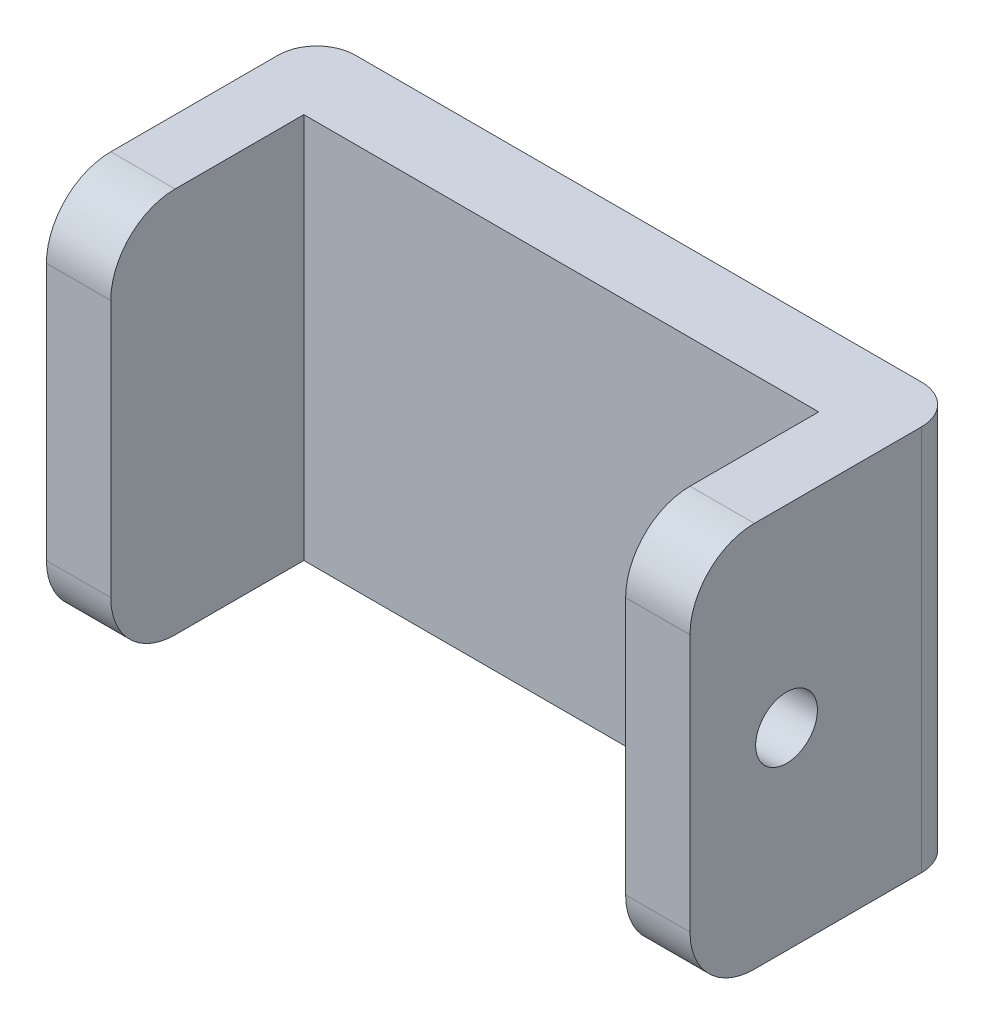
ISO-10303-21;
HEADER;
FILE_DESCRIPTION(('STEP AP214'),'2;1');
FILE_NAME('part.step','',(''),(''),'','','');
FILE_SCHEMA(('AUTOMOTIVE_DESIGN { 1 0 10303 214 1 1 1 1 }'));
ENDSEC;
DATA;
#1=APPLICATION_CONTEXT('core data for automotive mechanical design processes');
#2=APPLICATION_PROTOCOL_DEFINITION('international standard','automotive_design',2000,#1);
#3=PRODUCT_CONTEXT('',#1,'mechanical');
#4=PRODUCT('Part','Part','',(#3));
#5=PRODUCT_RELATED_PRODUCT_CATEGORY('part','',(#4));
#6=PRODUCT_DEFINITION_FORMATION('','',#4);
#7=PRODUCT_DEFINITION_CONTEXT('part definition',#1,'design');
#8=PRODUCT_DEFINITION('design','',#6,#7);
#9=PRODUCT_DEFINITION_SHAPE('','',#8);
#10=(LENGTH_UNIT() NAMED_UNIT(*) SI_UNIT(.MILLI.,.METRE.));
#11=(NAMED_UNIT(*) PLANE_ANGLE_UNIT() SI_UNIT($,.RADIAN.));
#12=(NAMED_UNIT(*) SI_UNIT($,.STERADIAN.) SOLID_ANGLE_UNIT());
#13=UNCERTAINTY_MEASURE_WITH_UNIT(LENGTH_MEASURE(1.E-05),#10,'distance_accuracy_value','');
#14=(GEOMETRIC_REPRESENTATION_CONTEXT(3) GLOBAL_UNCERTAINTY_ASSIGNED_CONTEXT((#13)) GLOBAL_UNIT_ASSIGNED_CONTEXT((#10,
#11,#12)) REPRESENTATION_CONTEXT('',''));
#15=CARTESIAN_POINT('',(0.,0.,0.));
#16=DIRECTION('',(0.,0.,1.));
#17=DIRECTION('',(1.,0.,0.));
#18=AXIS2_PLACEMENT_3D('',#15,#16,#17);
#19=CARTESIAN_POINT('',(0.,0.,6.));
#20=DIRECTION('',(0.,0.,1.));
#21=DIRECTION('',(1.,0.,0.));
#22=AXIS2_PLACEMENT_3D('',#19,#20,#21);
#23=PLANE('',#22);
#24=DIRECTION('',(-1.,0.,0.));
#25=VECTOR('',#24,1.);
#26=CARTESIAN_POINT('',(-286.5,-33.0000000000001,6.));
#27=LINE('',#26,#25);
#28=CARTESIAN_POINT('',(-241.5,-33.0000000000001,6.));
#29=VERTEX_POINT('',#28);
#30=CARTESIAN_POINT('',(-281.5,-33.0000000000001,6.));
#31=VERTEX_POINT('',#30);
#32=EDGE_CURVE('E155',#29,#31,#27,.T.);
#33=ORIENTED_EDGE('',*,*,#32,.T.);
#34=DIRECTION('',(0.,1.,0.));
#35=VECTOR('',#34,1.);
#36=CARTESIAN_POINT('',(-281.5,-63.0000000000001,6.));
#37=LINE('',#36,#35);
#38=CARTESIAN_POINT('',(-281.5,-63.0000000000001,6.));
#39=VERTEX_POINT('',#38);
#40=EDGE_CURVE('E154',#39,#31,#37,.T.);
#41=ORIENTED_EDGE('',*,*,#40,.F.);
#42=DIRECTION('',(1.,0.,0.));
#43=VECTOR('',#42,1.);
#44=CARTESIAN_POINT('',(-286.5,-63.0000000000001,6.));
#45=LINE('',#44,#43);
#46=CARTESIAN_POINT('',(-241.5,-63.0000000000001,6.));
#47=VERTEX_POINT('',#46);
#48=EDGE_CURVE('E138',#39,#47,#45,.T.);
#49=ORIENTED_EDGE('',*,*,#48,.T.);
#50=DIRECTION('',(0.,-1.,0.));
#51=VECTOR('',#50,1.);
#52=CARTESIAN_POINT('',(-241.5,-63.0000000000001,6.));
#53=LINE('',#52,#51);
#54=EDGE_CURVE('E151',#29,#47,#53,.T.);
#55=ORIENTED_EDGE('',*,*,#54,.F.);
#56=EDGE_LOOP('',(#33,#41,#49,#55));
#57=FACE_BOUND('',#56,.T.);
#58=ADVANCED_FACE('F32',(#57),#23,.T.);
#59=CARTESIAN_POINT('',(-286.5,-33.0000000000001,6.));
#60=DIRECTION('',(1.,0.,0.));
#61=DIRECTION('',(0.,0.,-1.));
#62=AXIS2_PLACEMENT_3D('',#59,#60,#61);
#63=PLANE('',#62);
#64=DIRECTION('',(0.,0.,-1.));
#65=VECTOR('',#64,1.);
#66=CARTESIAN_POINT('',(-286.5,-63.0000000000001,6.));
#67=LINE('',#66,#65);
#68=CARTESIAN_POINT('',(-286.5,-63.0000000000001,16.));
#69=VERTEX_POINT('',#68);
#70=CARTESIAN_POINT('',(-286.5,-63.0000000000001,3.));
#71=VERTEX_POINT('',#70);
#72=EDGE_CURVE('E182',#69,#71,#67,.T.);
#73=ORIENTED_EDGE('',*,*,#72,.F.);
#74=CARTESIAN_POINT('',(-286.5,-58.0000000000001,16.));
#75=DIRECTION('',(1.,0.,0.));
#76=DIRECTION('',(0.,0.,-1.));
#77=AXIS2_PLACEMENT_3D('',#74,#75,#76);
#78=CIRCLE('',#77,5.);
#79=CARTESIAN_POINT('',(-286.5,-58.0000000000001,21.));
#80=VERTEX_POINT('',#79);
#81=EDGE_CURVE('E11',#69,#80,#78,.F.);
#82=ORIENTED_EDGE('',*,*,#81,.T.);
#83=DIRECTION('',(0.,-1.,0.));
#84=VECTOR('',#83,1.);
#85=CARTESIAN_POINT('',(-286.5,-63.0000000000001,21.));
#86=LINE('',#85,#84);
#87=CARTESIAN_POINT('',(-286.5,-38.0000000000001,21.));
#88=VERTEX_POINT('',#87);
#89=EDGE_CURVE('E235',#88,#80,#86,.T.);
#90=ORIENTED_EDGE('',*,*,#89,.F.);
#91=CARTESIAN_POINT('',(-286.5,-38.0000000000001,16.));
#92=DIRECTION('',(1.,0.,0.));
#93=DIRECTION('',(0.,0.,-1.));
#94=AXIS2_PLACEMENT_3D('',#91,#92,#93);
#95=CIRCLE('',#94,5.);
#96=CARTESIAN_POINT('',(-286.5,-33.0000000000001,16.));
#97=VERTEX_POINT('',#96);
#98=EDGE_CURVE('E40',#88,#97,#95,.F.);
#99=ORIENTED_EDGE('',*,*,#98,.T.);
#100=DIRECTION('',(0.,0.,-1.));
#101=VECTOR('',#100,1.);
#102=CARTESIAN_POINT('',(-286.5,-33.0000000000001,6.));
#103=LINE('',#102,#101);
#104=CARTESIAN_POINT('',(-286.5,-33.0000000000001,3.));
#105=VERTEX_POINT('',#104);
#106=EDGE_CURVE('E172',#97,#105,#103,.T.);
#107=ORIENTED_EDGE('',*,*,#106,.T.);
#108=DIRECTION('',(0.,-1.,0.));
#109=VECTOR('',#108,1.);
#110=CARTESIAN_POINT('',(-286.5,-33.0000000000001,3.));
#111=LINE('',#110,#109);
#112=EDGE_CURVE('E184',#105,#71,#111,.T.);
#113=ORIENTED_EDGE('',*,*,#112,.T.);
#114=EDGE_LOOP('',(#73,#82,#90,#99,#107,#113));
#115=FACE_BOUND('',#114,.T.);
#116=ADVANCED_FACE('F234',(#115),#63,.F.);
#117=CARTESIAN_POINT('',(-286.5,-63.0000000000001,6.));
#118=DIRECTION('',(0.,1.,0.));
#119=DIRECTION('',(0.,0.,1.));
#120=AXIS2_PLACEMENT_3D('',#117,#118,#119);
#121=PLANE('',#120);
#122=DIRECTION('',(0.,0.,-1.));
#123=VECTOR('',#122,1.);
#124=CARTESIAN_POINT('',(-236.5,-63.0000000000001,6.));
#125=LINE('',#124,#123);
#126=CARTESIAN_POINT('',(-236.5,-63.0000000000001,16.));
#127=VERTEX_POINT('',#126);
#128=CARTESIAN_POINT('',(-236.5,-63.0000000000001,3.));
#129=VERTEX_POINT('',#128);
#130=EDGE_CURVE('E180',#127,#129,#125,.T.);
#131=ORIENTED_EDGE('',*,*,#130,.F.);
#132=DIRECTION('',(1.,0.,0.));
#133=VECTOR('',#132,1.);
#134=CARTESIAN_POINT('',(-241.5,-63.0000000000001,16.));
#135=LINE('',#134,#133);
#136=CARTESIAN_POINT('',(-241.5,-63.0000000000001,16.));
#137=VERTEX_POINT('',#136);
#138=EDGE_CURVE('E140',#127,#137,#135,.F.);
#139=ORIENTED_EDGE('',*,*,#138,.T.);
#140=DIRECTION('',(0.,0.,-1.));
#141=VECTOR('',#140,1.);
#142=CARTESIAN_POINT('',(-241.5,-63.0000000000001,21.));
#143=LINE('',#142,#141);
#144=EDGE_CURVE('E133',#137,#47,#143,.T.);
#145=ORIENTED_EDGE('',*,*,#144,.T.);
#146=ORIENTED_EDGE('',*,*,#48,.F.);
#147=DIRECTION('',(0.,0.,-1.));
#148=VECTOR('',#147,1.);
#149=CARTESIAN_POINT('',(-281.5,-63.0000000000001,21.));
#150=LINE('',#149,#148);
#151=CARTESIAN_POINT('',(-281.5,-63.0000000000001,16.));
#152=VERTEX_POINT('',#151);
#153=EDGE_CURVE('E161',#152,#39,#150,.T.);
#154=ORIENTED_EDGE('',*,*,#153,.F.);
#155=DIRECTION('',(1.,0.,0.));
#156=VECTOR('',#155,1.);
#157=CARTESIAN_POINT('',(-286.5,-63.0000000000001,16.));
#158=LINE('',#157,#156);
#159=EDGE_CURVE('E214',#152,#69,#158,.F.);
#160=ORIENTED_EDGE('',*,*,#159,.T.);
#161=ORIENTED_EDGE('',*,*,#72,.T.);
#162=CARTESIAN_POINT('',(-283.5,-63.0000000000001,3.));
#163=DIRECTION('',(0.,1.,0.));
#164=DIRECTION('',(0.,0.,1.));
#165=AXIS2_PLACEMENT_3D('',#162,#163,#164);
#166=CIRCLE('',#165,3.);
#167=CARTESIAN_POINT('',(-283.5,-63.0000000000001,0.));
#168=VERTEX_POINT('',#167);
#169=EDGE_CURVE('E190',#71,#168,#166,.F.);
#170=ORIENTED_EDGE('',*,*,#169,.T.);
#171=DIRECTION('',(1.,0.,0.));
#172=VECTOR('',#171,1.);
#173=CARTESIAN_POINT('',(-286.5,-63.0000000000001,0.));
#174=LINE('',#173,#172);
#175=CARTESIAN_POINT('',(-239.5,-63.0000000000001,0.));
#176=VERTEX_POINT('',#175);
#177=EDGE_CURVE('E169',#168,#176,#174,.T.);
#178=ORIENTED_EDGE('',*,*,#177,.T.);
#179=CARTESIAN_POINT('',(-239.5,-63.0000000000001,3.));
#180=DIRECTION('',(0.,1.,0.));
#181=DIRECTION('',(0.,0.,1.));
#182=AXIS2_PLACEMENT_3D('',#179,#180,#181);
#183=CIRCLE('',#182,3.);
#184=EDGE_CURVE('E187',#176,#129,#183,.F.);
#185=ORIENTED_EDGE('',*,*,#184,.T.);
#186=EDGE_LOOP('',(#131,#139,#145,#146,#154,#160,#161,#170,#178,#185));
#187=FACE_BOUND('',#186,.T.);
#188=ADVANCED_FACE('F136',(#187),#121,.F.);
#189=CARTESIAN_POINT('',(-236.5,-33.0000000000001,6.));
#190=DIRECTION('',(-1.,0.,0.));
#191=DIRECTION('',(0.,-1.,0.));
#192=AXIS2_PLACEMENT_3D('',#189,#190,#191);
#193=PLANE('',#192);
#194=CARTESIAN_POINT('',(-236.5,-48.0000000000001,13.5));
#195=DIRECTION('',(1.,0.,0.));
#196=DIRECTION('',(0.,1.,0.));
#197=AXIS2_PLACEMENT_3D('',#194,#195,#196);
#198=CIRCLE('',#197,2.4);
#199=CARTESIAN_POINT('',(-236.5,-45.6000000000001,13.5));
#200=VERTEX_POINT('',#199);
#201=EDGE_CURVE('E341',#200,#200,#198,.T.);
#202=ORIENTED_EDGE('',*,*,#201,.F.);
#203=EDGE_LOOP('',(#202));
#204=FACE_BOUND('',#203,.T.);
#205=DIRECTION('',(0.,1.,0.));
#206=VECTOR('',#205,1.);
#207=CARTESIAN_POINT('',(-236.5,-63.0000000000001,21.));
#208=LINE('',#207,#206);
#209=CARTESIAN_POINT('',(-236.5,-58.0000000000001,21.));
#210=VERTEX_POINT('',#209);
#211=CARTESIAN_POINT('',(-236.5,-38.0000000000001,21.));
#212=VERTEX_POINT('',#211);
#213=EDGE_CURVE('E160',#210,#212,#208,.T.);
#214=ORIENTED_EDGE('',*,*,#213,.F.);
#215=CARTESIAN_POINT('',(-236.5,-58.0000000000001,16.));
#216=DIRECTION('',(-1.,0.,0.));
#217=DIRECTION('',(0.,-1.,0.));
#218=AXIS2_PLACEMENT_3D('',#215,#216,#217);
#219=CIRCLE('',#218,5.);
#220=EDGE_CURVE('E212',#210,#127,#219,.F.);
#221=ORIENTED_EDGE('',*,*,#220,.T.);
#222=ORIENTED_EDGE('',*,*,#130,.T.);
#223=DIRECTION('',(0.,1.,0.));
#224=VECTOR('',#223,1.);
#225=CARTESIAN_POINT('',(-236.5,-33.0000000000001,3.));
#226=LINE('',#225,#224);
#227=CARTESIAN_POINT('',(-236.5,-33.0000000000001,3.));
#228=VERTEX_POINT('',#227);
#229=EDGE_CURVE('E201',#129,#228,#226,.T.);
#230=ORIENTED_EDGE('',*,*,#229,.T.);
#231=DIRECTION('',(0.,0.,-1.));
#232=VECTOR('',#231,1.);
#233=CARTESIAN_POINT('',(-236.5,-33.0000000000001,6.));
#234=LINE('',#233,#232);
#235=CARTESIAN_POINT('',(-236.5,-33.0000000000001,16.));
#236=VERTEX_POINT('',#235);
#237=EDGE_CURVE('E178',#236,#228,#234,.T.);
#238=ORIENTED_EDGE('',*,*,#237,.F.);
#239=CARTESIAN_POINT('',(-236.5,-38.0000000000001,16.));
#240=DIRECTION('',(-1.,0.,0.));
#241=DIRECTION('',(0.,-1.,0.));
#242=AXIS2_PLACEMENT_3D('',#239,#240,#241);
#243=CIRCLE('',#242,5.);
#244=EDGE_CURVE('E210',#236,#212,#243,.F.);
#245=ORIENTED_EDGE('',*,*,#244,.T.);
#246=EDGE_LOOP('',(#214,#221,#222,#230,#238,#245));
#247=FACE_BOUND('',#246,.T.);
#248=ADVANCED_FACE('F284',(#204,#247),#193,.F.);
#249=CARTESIAN_POINT('',(-286.5,-33.0000000000001,6.));
#250=DIRECTION('',(0.,-1.,0.));
#251=DIRECTION('',(0.,0.,-1.));
#252=AXIS2_PLACEMENT_3D('',#249,#250,#251);
#253=PLANE('',#252);
#254=DIRECTION('',(0.,0.,-1.));
#255=VECTOR('',#254,1.);
#256=CARTESIAN_POINT('',(-241.5,-33.0000000000001,21.));
#257=LINE('',#256,#255);
#258=CARTESIAN_POINT('',(-241.5,-33.0000000000001,16.));
#259=VERTEX_POINT('',#258);
#260=EDGE_CURVE('E144',#259,#29,#257,.T.);
#261=ORIENTED_EDGE('',*,*,#260,.F.);
#262=DIRECTION('',(-1.,0.,0.));
#263=VECTOR('',#262,1.);
#264=CARTESIAN_POINT('',(-236.5,-33.0000000000001,16.));
#265=LINE('',#264,#263);
#266=EDGE_CURVE('E223',#259,#236,#265,.F.);
#267=ORIENTED_EDGE('',*,*,#266,.T.);
#268=ORIENTED_EDGE('',*,*,#237,.T.);
#269=CARTESIAN_POINT('',(-239.5,-33.0000000000001,3.));
#270=DIRECTION('',(0.,-1.,0.));
#271=DIRECTION('',(0.,0.,-1.));
#272=AXIS2_PLACEMENT_3D('',#269,#270,#271);
#273=CIRCLE('',#272,3.);
#274=CARTESIAN_POINT('',(-239.5,-33.0000000000001,0.));
#275=VERTEX_POINT('',#274);
#276=EDGE_CURVE('E196',#228,#275,#273,.F.);
#277=ORIENTED_EDGE('',*,*,#276,.T.);
#278=DIRECTION('',(-1.,0.,0.));
#279=VECTOR('',#278,1.);
#280=CARTESIAN_POINT('',(-286.5,-33.0000000000001,0.));
#281=LINE('',#280,#279);
#282=CARTESIAN_POINT('',(-283.5,-33.0000000000001,0.));
#283=VERTEX_POINT('',#282);
#284=EDGE_CURVE('E156',#275,#283,#281,.T.);
#285=ORIENTED_EDGE('',*,*,#284,.T.);
#286=CARTESIAN_POINT('',(-283.5,-33.0000000000001,3.));
#287=DIRECTION('',(0.,-1.,0.));
#288=DIRECTION('',(0.,0.,-1.));
#289=AXIS2_PLACEMENT_3D('',#286,#287,#288);
#290=CIRCLE('',#289,3.);
#291=EDGE_CURVE('E198',#283,#105,#290,.F.);
#292=ORIENTED_EDGE('',*,*,#291,.T.);
#293=ORIENTED_EDGE('',*,*,#106,.F.);
#294=DIRECTION('',(-1.,0.,0.));
#295=VECTOR('',#294,1.);
#296=CARTESIAN_POINT('',(-281.5,-33.0000000000001,16.));
#297=LINE('',#296,#295);
#298=CARTESIAN_POINT('',(-281.5,-33.0000000000001,16.));
#299=VERTEX_POINT('',#298);
#300=EDGE_CURVE('E221',#97,#299,#297,.F.);
#301=ORIENTED_EDGE('',*,*,#300,.T.);
#302=DIRECTION('',(0.,0.,-1.));
#303=VECTOR('',#302,1.);
#304=CARTESIAN_POINT('',(-281.5,-33.0000000000001,21.));
#305=LINE('',#304,#303);
#306=EDGE_CURVE('E165',#299,#31,#305,.T.);
#307=ORIENTED_EDGE('',*,*,#306,.T.);
#308=ORIENTED_EDGE('',*,*,#32,.F.);
#309=EDGE_LOOP('',(#261,#267,#268,#277,#285,#292,#293,#301,#307,#308));
#310=FACE_BOUND('',#309,.T.);
#311=ADVANCED_FACE('F237',(#310),#253,.F.);
#312=CARTESIAN_POINT('',(0.,0.,0.));
#313=DIRECTION('',(0.,0.,1.));
#314=DIRECTION('',(1.,0.,0.));
#315=AXIS2_PLACEMENT_3D('',#312,#313,#314);
#316=PLANE('',#315);
#317=ORIENTED_EDGE('',*,*,#177,.F.);
#318=DIRECTION('',(0.,-1.,0.));
#319=VECTOR('',#318,1.);
#320=CARTESIAN_POINT('',(-283.5,0.,0.));
#321=LINE('',#320,#319);
#322=EDGE_CURVE('E194',#168,#283,#321,.F.);
#323=ORIENTED_EDGE('',*,*,#322,.T.);
#324=ORIENTED_EDGE('',*,*,#284,.F.);
#325=DIRECTION('',(0.,1.,0.));
#326=VECTOR('',#325,1.);
#327=CARTESIAN_POINT('',(-239.5,2.21582011998104E-13,0.));
#328=LINE('',#327,#326);
#329=EDGE_CURVE('E192',#275,#176,#328,.F.);
#330=ORIENTED_EDGE('',*,*,#329,.T.);
#331=EDGE_LOOP('',(#317,#323,#324,#330));
#332=FACE_BOUND('',#331,.T.);
#333=ADVANCED_FACE('F278',(#332),#316,.F.);
#334=CARTESIAN_POINT('',(-241.5,-63.0000000000001,21.));
#335=DIRECTION('',(1.,0.,0.));
#336=DIRECTION('',(0.,0.,-1.));
#337=AXIS2_PLACEMENT_3D('',#334,#335,#336);
#338=PLANE('',#337);
#339=CARTESIAN_POINT('',(-241.5,-48.0000000000001,13.5));
#340=DIRECTION('',(1.,0.,0.));
#341=DIRECTION('',(0.,0.,-1.));
#342=AXIS2_PLACEMENT_3D('',#339,#340,#341);
#343=CIRCLE('',#342,2.4);
#344=CARTESIAN_POINT('',(-241.5,-48.0000000000001,11.1));
#345=VERTEX_POINT('',#344);
#346=EDGE_CURVE('E252',#345,#345,#343,.F.);
#347=ORIENTED_EDGE('',*,*,#346,.F.);
#348=EDGE_LOOP('',(#347));
#349=FACE_BOUND('',#348,.T.);
#350=ORIENTED_EDGE('',*,*,#144,.F.);
#351=CARTESIAN_POINT('',(-241.5,-58.0000000000001,16.));
#352=DIRECTION('',(1.,0.,0.));
#353=DIRECTION('',(0.,0.,-1.));
#354=AXIS2_PLACEMENT_3D('',#351,#352,#353);
#355=CIRCLE('',#354,5.);
#356=CARTESIAN_POINT('',(-241.5,-58.0000000000001,21.));
#357=VERTEX_POINT('',#356);
#358=EDGE_CURVE('E219',#137,#357,#355,.F.);
#359=ORIENTED_EDGE('',*,*,#358,.T.);
#360=DIRECTION('',(0.,-1.,0.));
#361=VECTOR('',#360,1.);
#362=CARTESIAN_POINT('',(-241.5,-63.0000000000001,21.));
#363=LINE('',#362,#361);
#364=CARTESIAN_POINT('',(-241.5,-38.0000000000001,21.));
#365=VERTEX_POINT('',#364);
#366=EDGE_CURVE('E145',#365,#357,#363,.T.);
#367=ORIENTED_EDGE('',*,*,#366,.F.);
#368=CARTESIAN_POINT('',(-241.5,-38.0000000000001,16.));
#369=DIRECTION('',(1.,0.,0.));
#370=DIRECTION('',(0.,0.,-1.));
#371=AXIS2_PLACEMENT_3D('',#368,#369,#370);
#372=CIRCLE('',#371,5.);
#373=EDGE_CURVE('E217',#365,#259,#372,.F.);
#374=ORIENTED_EDGE('',*,*,#373,.T.);
#375=ORIENTED_EDGE('',*,*,#260,.T.);
#376=ORIENTED_EDGE('',*,*,#54,.T.);
#377=EDGE_LOOP('',(#350,#359,#367,#374,#375,#376));
#378=FACE_BOUND('',#377,.T.);
#379=ADVANCED_FACE('F158',(#349,#378),#338,.F.);
#380=CARTESIAN_POINT('',(0.,0.,21.));
#381=DIRECTION('',(0.,0.,1.));
#382=DIRECTION('',(1.,0.,0.));
#383=AXIS2_PLACEMENT_3D('',#380,#381,#382);
#384=PLANE('',#383);
#385=ORIENTED_EDGE('',*,*,#366,.T.);
#386=DIRECTION('',(1.,0.,0.));
#387=VECTOR('',#386,1.);
#388=CARTESIAN_POINT('',(-236.5,-58.0000000000001,21.));
#389=LINE('',#388,#387);
#390=EDGE_CURVE('E207',#357,#210,#389,.T.);
#391=ORIENTED_EDGE('',*,*,#390,.T.);
#392=ORIENTED_EDGE('',*,*,#213,.T.);
#393=DIRECTION('',(-1.,0.,0.));
#394=VECTOR('',#393,1.);
#395=CARTESIAN_POINT('',(-241.5,-38.0000000000001,21.));
#396=LINE('',#395,#394);
#397=EDGE_CURVE('E204',#212,#365,#396,.T.);
#398=ORIENTED_EDGE('',*,*,#397,.T.);
#399=EDGE_LOOP('',(#385,#391,#392,#398));
#400=FACE_BOUND('',#399,.T.);
#401=ADVANCED_FACE('F307',(#400),#384,.T.);
#402=CARTESIAN_POINT('',(-281.5,-63.0000000000001,21.));
#403=DIRECTION('',(-1.,0.,0.));
#404=DIRECTION('',(0.,-1.,0.));
#405=AXIS2_PLACEMENT_3D('',#402,#403,#404);
#406=PLANE('',#405);
#407=DIRECTION('',(0.,1.,0.));
#408=VECTOR('',#407,1.);
#409=CARTESIAN_POINT('',(-281.5,-63.0000000000001,21.));
#410=LINE('',#409,#408);
#411=CARTESIAN_POINT('',(-281.5,-58.0000000000001,21.));
#412=VERTEX_POINT('',#411);
#413=CARTESIAN_POINT('',(-281.5,-38.0000000000001,21.));
#414=VERTEX_POINT('',#413);
#415=EDGE_CURVE('E246',#412,#414,#410,.T.);
#416=ORIENTED_EDGE('',*,*,#415,.F.);
#417=CARTESIAN_POINT('',(-281.5,-58.0000000000001,16.));
#418=DIRECTION('',(-1.,0.,0.));
#419=DIRECTION('',(0.,-1.,0.));
#420=AXIS2_PLACEMENT_3D('',#417,#418,#419);
#421=CIRCLE('',#420,5.);
#422=EDGE_CURVE('E232',#412,#152,#421,.F.);
#423=ORIENTED_EDGE('',*,*,#422,.T.);
#424=ORIENTED_EDGE('',*,*,#153,.T.);
#425=ORIENTED_EDGE('',*,*,#40,.T.);
#426=ORIENTED_EDGE('',*,*,#306,.F.);
#427=CARTESIAN_POINT('',(-281.5,-38.0000000000001,16.));
#428=DIRECTION('',(-1.,0.,0.));
#429=DIRECTION('',(0.,-1.,0.));
#430=AXIS2_PLACEMENT_3D('',#427,#428,#429);
#431=CIRCLE('',#430,5.);
#432=EDGE_CURVE('E230',#299,#414,#431,.F.);
#433=ORIENTED_EDGE('',*,*,#432,.T.);
#434=EDGE_LOOP('',(#416,#423,#424,#425,#426,#433));
#435=FACE_BOUND('',#434,.T.);
#436=ADVANCED_FACE('F245',(#435),#406,.F.);
#437=CARTESIAN_POINT('',(0.,0.,21.));
#438=DIRECTION('',(0.,0.,1.));
#439=DIRECTION('',(1.,0.,0.));
#440=AXIS2_PLACEMENT_3D('',#437,#438,#439);
#441=PLANE('',#440);
#442=ORIENTED_EDGE('',*,*,#89,.T.);
#443=DIRECTION('',(1.,0.,0.));
#444=VECTOR('',#443,1.);
#445=CARTESIAN_POINT('',(-281.5,-58.0000000000001,21.));
#446=LINE('',#445,#444);
#447=EDGE_CURVE('E227',#80,#412,#446,.T.);
#448=ORIENTED_EDGE('',*,*,#447,.T.);
#449=ORIENTED_EDGE('',*,*,#415,.T.);
#450=DIRECTION('',(-1.,0.,0.));
#451=VECTOR('',#450,1.);
#452=CARTESIAN_POINT('',(-286.5,-38.0000000000001,21.));
#453=LINE('',#452,#451);
#454=EDGE_CURVE('E225',#414,#88,#453,.T.);
#455=ORIENTED_EDGE('',*,*,#454,.T.);
#456=EDGE_LOOP('',(#442,#448,#449,#455));
#457=FACE_BOUND('',#456,.T.);
#458=ADVANCED_FACE('F248',(#457),#441,.T.);
#459=CARTESIAN_POINT('',(-248.288225099391,-48.0000000000001,13.5));
#460=DIRECTION('',(1.,0.,0.));
#461=DIRECTION('',(0.,1.,0.));
#462=AXIS2_PLACEMENT_3D('',#459,#460,#461);
#463=CYLINDRICAL_SURFACE('',#462,2.4);
#464=ORIENTED_EDGE('',*,*,#346,.T.);
#465=EDGE_LOOP('',(#464));
#466=FACE_BOUND('',#465,.T.);
#467=ORIENTED_EDGE('',*,*,#201,.T.);
#468=EDGE_LOOP('',(#467));
#469=FACE_BOUND('',#468,.T.);
#470=ADVANCED_FACE('F294',(#466,#469),#463,.F.);
#471=CARTESIAN_POINT('',(-283.5,-33.0000000000001,3.));
#472=DIRECTION('',(0.,-1.,0.));
#473=DIRECTION('',(0.,0.,-1.));
#474=AXIS2_PLACEMENT_3D('',#471,#472,#473);
#475=CYLINDRICAL_SURFACE('',#474,3.);
#476=ORIENTED_EDGE('',*,*,#291,.F.);
#477=ORIENTED_EDGE('',*,*,#322,.F.);
#478=ORIENTED_EDGE('',*,*,#169,.F.);
#479=ORIENTED_EDGE('',*,*,#112,.F.);
#480=EDGE_LOOP('',(#476,#477,#478,#479));
#481=FACE_BOUND('',#480,.T.);
#482=ADVANCED_FACE('F290',(#481),#475,.T.);
#483=CARTESIAN_POINT('',(-239.5,-33.0000000000001,3.));
#484=DIRECTION('',(0.,1.,0.));
#485=DIRECTION('',(-1.,0.,0.));
#486=AXIS2_PLACEMENT_3D('',#483,#484,#485);
#487=CYLINDRICAL_SURFACE('',#486,3.);
#488=ORIENTED_EDGE('',*,*,#184,.F.);
#489=ORIENTED_EDGE('',*,*,#329,.F.);
#490=ORIENTED_EDGE('',*,*,#276,.F.);
#491=ORIENTED_EDGE('',*,*,#229,.F.);
#492=EDGE_LOOP('',(#488,#489,#490,#491));
#493=FACE_BOUND('',#492,.T.);
#494=ADVANCED_FACE('F293',(#493),#487,.T.);
#495=CARTESIAN_POINT('',(0.,-58.0000000000001,16.));
#496=DIRECTION('',(-1.,0.,0.));
#497=DIRECTION('',(0.,0.,1.));
#498=AXIS2_PLACEMENT_3D('',#495,#496,#497);
#499=CYLINDRICAL_SURFACE('',#498,5.);
#500=ORIENTED_EDGE('',*,*,#358,.F.);
#501=ORIENTED_EDGE('',*,*,#138,.F.);
#502=ORIENTED_EDGE('',*,*,#220,.F.);
#503=ORIENTED_EDGE('',*,*,#390,.F.);
#504=EDGE_LOOP('',(#500,#501,#502,#503));
#505=FACE_BOUND('',#504,.T.);
#506=ADVANCED_FACE('F266',(#505),#499,.T.);
#507=CARTESIAN_POINT('',(0.,-38.0000000000001,16.));
#508=DIRECTION('',(1.,0.,0.));
#509=DIRECTION('',(0.,0.,-1.));
#510=AXIS2_PLACEMENT_3D('',#507,#508,#509);
#511=CYLINDRICAL_SURFACE('',#510,5.);
#512=ORIENTED_EDGE('',*,*,#244,.F.);
#513=ORIENTED_EDGE('',*,*,#266,.F.);
#514=ORIENTED_EDGE('',*,*,#373,.F.);
#515=ORIENTED_EDGE('',*,*,#397,.F.);
#516=EDGE_LOOP('',(#512,#513,#514,#515));
#517=FACE_BOUND('',#516,.T.);
#518=ADVANCED_FACE('F261',(#517),#511,.T.);
#519=CARTESIAN_POINT('',(0.,-58.0000000000001,16.));
#520=DIRECTION('',(-1.,0.,0.));
#521=DIRECTION('',(0.,0.,1.));
#522=AXIS2_PLACEMENT_3D('',#519,#520,#521);
#523=CYLINDRICAL_SURFACE('',#522,5.);
#524=ORIENTED_EDGE('',*,*,#81,.F.);
#525=ORIENTED_EDGE('',*,*,#159,.F.);
#526=ORIENTED_EDGE('',*,*,#422,.F.);
#527=ORIENTED_EDGE('',*,*,#447,.F.);
#528=EDGE_LOOP('',(#524,#525,#526,#527));
#529=FACE_BOUND('',#528,.T.);
#530=ADVANCED_FACE('F259',(#529),#523,.T.);
#531=CARTESIAN_POINT('',(0.,-38.0000000000001,16.));
#532=DIRECTION('',(1.,0.,0.));
#533=DIRECTION('',(0.,0.,-1.));
#534=AXIS2_PLACEMENT_3D('',#531,#532,#533);
#535=CYLINDRICAL_SURFACE('',#534,5.);
#536=ORIENTED_EDGE('',*,*,#432,.F.);
#537=ORIENTED_EDGE('',*,*,#300,.F.);
#538=ORIENTED_EDGE('',*,*,#98,.F.);
#539=ORIENTED_EDGE('',*,*,#454,.F.);
#540=EDGE_LOOP('',(#536,#537,#538,#539));
#541=FACE_BOUND('',#540,.T.);
#542=ADVANCED_FACE('F34',(#541),#535,.T.);
#543=CLOSED_SHELL('',(#58,#116,#188,#248,#311,#333,#379,#401,#436,#458,#470,#482,#494,#506,#518,
#530,#542));
#544=MANIFOLD_SOLID_BREP('B2',#543);
#545=ADVANCED_BREP_SHAPE_REPRESENTATION('',(#18,#544),#14);
#546=SHAPE_DEFINITION_REPRESENTATION(#9,#545);
ENDSEC;
END-ISO-10303-21;
